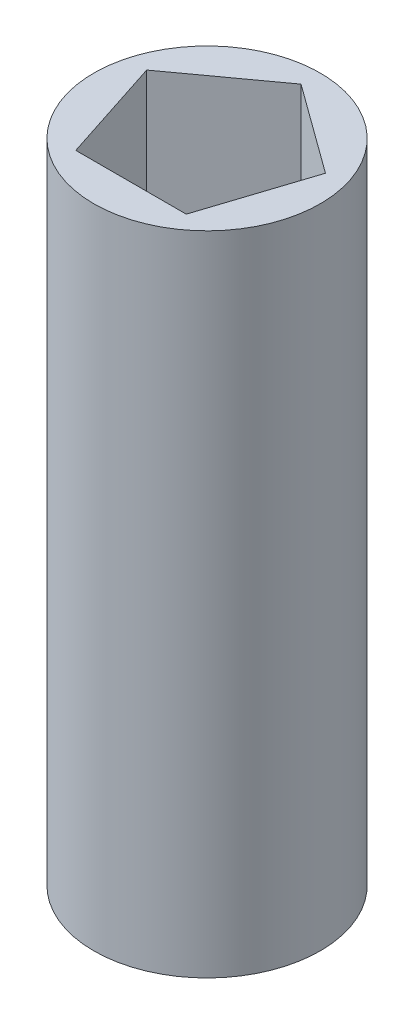
ISO-10303-21;
HEADER;
FILE_DESCRIPTION(('STEP AP214'),'2;1');
FILE_NAME('part.step','',(''),(''),'','','');
FILE_SCHEMA(('AUTOMOTIVE_DESIGN { 1 0 10303 214 1 1 1 1 }'));
ENDSEC;
DATA;
#1=APPLICATION_CONTEXT('core data for automotive mechanical design processes');
#2=APPLICATION_PROTOCOL_DEFINITION('international standard','automotive_design',2000,#1);
#3=PRODUCT_CONTEXT('',#1,'mechanical');
#4=PRODUCT('Part','Part','',(#3));
#5=PRODUCT_RELATED_PRODUCT_CATEGORY('part','',(#4));
#6=PRODUCT_DEFINITION_FORMATION('','',#4);
#7=PRODUCT_DEFINITION_CONTEXT('part definition',#1,'design');
#8=PRODUCT_DEFINITION('design','',#6,#7);
#9=PRODUCT_DEFINITION_SHAPE('','',#8);
#10=(LENGTH_UNIT() NAMED_UNIT(*) SI_UNIT(.MILLI.,.METRE.));
#11=(NAMED_UNIT(*) PLANE_ANGLE_UNIT() SI_UNIT($,.RADIAN.));
#12=(NAMED_UNIT(*) SI_UNIT($,.STERADIAN.) SOLID_ANGLE_UNIT());
#13=UNCERTAINTY_MEASURE_WITH_UNIT(LENGTH_MEASURE(1.E-05),#10,'distance_accuracy_value','');
#14=(GEOMETRIC_REPRESENTATION_CONTEXT(3) GLOBAL_UNCERTAINTY_ASSIGNED_CONTEXT((#13)) GLOBAL_UNIT_ASSIGNED_CONTEXT((#10,
#11,#12)) REPRESENTATION_CONTEXT('',''));
#15=CARTESIAN_POINT('',(0.,0.,0.));
#16=DIRECTION('',(0.,0.,1.));
#17=DIRECTION('',(1.,0.,0.));
#18=AXIS2_PLACEMENT_3D('',#15,#16,#17);
#19=CARTESIAN_POINT('',(0.,20.,0.));
#20=DIRECTION('',(0.,1.,0.));
#21=DIRECTION('',(0.,0.,1.));
#22=AXIS2_PLACEMENT_3D('',#19,#20,#21);
#23=PLANE('',#22);
#24=CARTESIAN_POINT('',(0.,20.,0.));
#25=DIRECTION('',(0.,1.,0.));
#26=DIRECTION('',(0.,0.,1.));
#27=AXIS2_PLACEMENT_3D('',#24,#25,#26);
#28=CIRCLE('',#27,3.5);
#29=CARTESIAN_POINT('',(0.,20.,3.5));
#30=VERTEX_POINT('',#29);
#31=EDGE_CURVE('E11',#30,#30,#28,.T.);
#32=ORIENTED_EDGE('',*,*,#31,.T.);
#33=EDGE_LOOP('',(#32));
#34=FACE_BOUND('',#33,.T.);
#35=DIRECTION('',(0.309016994374947,0.,-0.951056516295154));
#36=VECTOR('',#35,1.);
#37=CARTESIAN_POINT('',(1.7073749408126,20.,2.35));
#38=LINE('',#37,#36);
#39=CARTESIAN_POINT('',(1.7073749408126,20.,2.35));
#40=VERTEX_POINT('',#39);
#41=CARTESIAN_POINT('',(2.76259068577462,20.,-0.897620126437749));
#42=VERTEX_POINT('',#41);
#43=EDGE_CURVE('E88',#40,#42,#38,.T.);
#44=ORIENTED_EDGE('',*,*,#43,.F.);
#45=DIRECTION('',(1.,0.,0.));
#46=VECTOR('',#45,1.);
#47=CARTESIAN_POINT('',(-1.7073749408126,20.,2.35));
#48=LINE('',#47,#46);
#49=CARTESIAN_POINT('',(-1.7073749408126,20.,2.35));
#50=VERTEX_POINT('',#49);
#51=EDGE_CURVE('E80',#50,#40,#48,.T.);
#52=ORIENTED_EDGE('',*,*,#51,.F.);
#53=DIRECTION('',(0.309016994374948,0.,0.951056516295154));
#54=VECTOR('',#53,1.);
#55=CARTESIAN_POINT('',(-2.76259068577462,20.,-0.897620126437747));
#56=LINE('',#55,#54);
#57=CARTESIAN_POINT('',(-2.76259068577463,20.,-0.897620126437747));
#58=VERTEX_POINT('',#57);
#59=EDGE_CURVE('E106',#58,#50,#56,.T.);
#60=ORIENTED_EDGE('',*,*,#59,.F.);
#61=DIRECTION('',(-0.809016994374947,0.,0.587785252292473));
#62=VECTOR('',#61,1.);
#63=CARTESIAN_POINT('',(0.,20.,-2.90475974712451));
#64=LINE('',#63,#62);
#65=CARTESIAN_POINT('',(0.,20.,-2.90475974712451));
#66=VERTEX_POINT('',#65);
#67=EDGE_CURVE('E102',#66,#58,#64,.T.);
#68=ORIENTED_EDGE('',*,*,#67,.F.);
#69=DIRECTION('',(-0.809016994374948,0.,-0.587785252292473));
#70=VECTOR('',#69,1.);
#71=CARTESIAN_POINT('',(2.76259068577462,20.,-0.897620126437749));
#72=LINE('',#71,#70);
#73=EDGE_CURVE('E100',#42,#66,#72,.T.);
#74=ORIENTED_EDGE('',*,*,#73,.F.);
#75=EDGE_LOOP('',(#44,#52,#60,#68,#74));
#76=FACE_BOUND('',#75,.T.);
#77=ADVANCED_FACE('F33',(#34,#76),#23,.T.);
#78=CARTESIAN_POINT('',(0.,0.,0.));
#79=DIRECTION('',(0.,1.,0.));
#80=DIRECTION('',(0.,0.,1.));
#81=AXIS2_PLACEMENT_3D('',#78,#79,#80);
#82=PLANE('',#81);
#83=CARTESIAN_POINT('',(0.,0.,0.));
#84=DIRECTION('',(0.,1.,0.));
#85=DIRECTION('',(0.,0.,1.));
#86=AXIS2_PLACEMENT_3D('',#83,#84,#85);
#87=CIRCLE('',#86,3.5);
#88=CARTESIAN_POINT('',(0.,0.,3.5));
#89=VERTEX_POINT('',#88);
#90=EDGE_CURVE('E37',#89,#89,#87,.T.);
#91=ORIENTED_EDGE('',*,*,#90,.F.);
#92=EDGE_LOOP('',(#91));
#93=FACE_BOUND('',#92,.T.);
#94=DIRECTION('',(1.,0.,0.));
#95=VECTOR('',#94,1.);
#96=CARTESIAN_POINT('',(-1.7073749408126,0.,2.35));
#97=LINE('',#96,#95);
#98=CARTESIAN_POINT('',(-1.7073749408126,0.,2.35));
#99=VERTEX_POINT('',#98);
#100=CARTESIAN_POINT('',(1.7073749408126,0.,2.35));
#101=VERTEX_POINT('',#100);
#102=EDGE_CURVE('E56',#99,#101,#97,.T.);
#103=ORIENTED_EDGE('',*,*,#102,.T.);
#104=DIRECTION('',(0.309016994374947,0.,-0.951056516295154));
#105=VECTOR('',#104,1.);
#106=CARTESIAN_POINT('',(1.7073749408126,0.,2.35));
#107=LINE('',#106,#105);
#108=CARTESIAN_POINT('',(2.76259068577462,0.,-0.897620126437749));
#109=VERTEX_POINT('',#108);
#110=EDGE_CURVE('E95',#101,#109,#107,.T.);
#111=ORIENTED_EDGE('',*,*,#110,.T.);
#112=DIRECTION('',(-0.809016994374948,0.,-0.587785252292473));
#113=VECTOR('',#112,1.);
#114=CARTESIAN_POINT('',(2.76259068577462,0.,-0.897620126437749));
#115=LINE('',#114,#113);
#116=CARTESIAN_POINT('',(0.,0.,-2.90475974712451));
#117=VERTEX_POINT('',#116);
#118=EDGE_CURVE('E110',#109,#117,#115,.T.);
#119=ORIENTED_EDGE('',*,*,#118,.T.);
#120=DIRECTION('',(-0.809016994374947,0.,0.587785252292473));
#121=VECTOR('',#120,1.);
#122=CARTESIAN_POINT('',(0.,0.,-2.90475974712451));
#123=LINE('',#122,#121);
#124=CARTESIAN_POINT('',(-2.76259068577462,0.,-0.897620126437747));
#125=VERTEX_POINT('',#124);
#126=EDGE_CURVE('E113',#117,#125,#123,.T.);
#127=ORIENTED_EDGE('',*,*,#126,.T.);
#128=DIRECTION('',(0.309016994374948,0.,0.951056516295154));
#129=VECTOR('',#128,1.);
#130=CARTESIAN_POINT('',(-2.76259068577462,0.,-0.897620126437747));
#131=LINE('',#130,#129);
#132=EDGE_CURVE('E89',#125,#99,#131,.T.);
#133=ORIENTED_EDGE('',*,*,#132,.T.);
#134=EDGE_LOOP('',(#103,#111,#119,#127,#133));
#135=FACE_BOUND('',#134,.T.);
#136=ADVANCED_FACE('F128',(#93,#135),#82,.F.);
#137=CARTESIAN_POINT('',(0.,20.,0.));
#138=DIRECTION('',(0.,-1.,0.));
#139=DIRECTION('',(0.,0.,-1.));
#140=AXIS2_PLACEMENT_3D('',#137,#138,#139);
#141=CYLINDRICAL_SURFACE('',#140,3.5);
#142=ORIENTED_EDGE('',*,*,#31,.F.);
#143=EDGE_LOOP('',(#142));
#144=FACE_BOUND('',#143,.T.);
#145=ORIENTED_EDGE('',*,*,#90,.T.);
#146=EDGE_LOOP('',(#145));
#147=FACE_BOUND('',#146,.T.);
#148=ADVANCED_FACE('F35',(#144,#147),#141,.T.);
#149=CARTESIAN_POINT('',(-1.7073749408126,20.,2.35));
#150=DIRECTION('',(0.,0.,-1.));
#151=DIRECTION('',(-1.,0.,0.));
#152=AXIS2_PLACEMENT_3D('',#149,#150,#151);
#153=PLANE('',#152);
#154=ORIENTED_EDGE('',*,*,#102,.F.);
#155=DIRECTION('',(0.,-1.,0.));
#156=VECTOR('',#155,1.);
#157=CARTESIAN_POINT('',(-1.7073749408126,20.,2.35));
#158=LINE('',#157,#156);
#159=EDGE_CURVE('E84',#50,#99,#158,.T.);
#160=ORIENTED_EDGE('',*,*,#159,.F.);
#161=ORIENTED_EDGE('',*,*,#51,.T.);
#162=DIRECTION('',(0.,-1.,0.));
#163=VECTOR('',#162,1.);
#164=CARTESIAN_POINT('',(1.7073749408126,20.,2.35));
#165=LINE('',#164,#163);
#166=EDGE_CURVE('E83',#40,#101,#165,.T.);
#167=ORIENTED_EDGE('',*,*,#166,.T.);
#168=EDGE_LOOP('',(#154,#160,#161,#167));
#169=FACE_BOUND('',#168,.T.);
#170=ADVANCED_FACE('F82',(#169),#153,.T.);
#171=CARTESIAN_POINT('',(1.7073749408126,20.,2.35));
#172=DIRECTION('',(-0.951056516295154,0.,-0.309016994374947));
#173=DIRECTION('',(-0.309016994374947,0.,0.951056516295154));
#174=AXIS2_PLACEMENT_3D('',#171,#172,#173);
#175=PLANE('',#174);
#176=ORIENTED_EDGE('',*,*,#110,.F.);
#177=ORIENTED_EDGE('',*,*,#166,.F.);
#178=ORIENTED_EDGE('',*,*,#43,.T.);
#179=DIRECTION('',(0.,-1.,0.));
#180=VECTOR('',#179,1.);
#181=CARTESIAN_POINT('',(2.76259068577462,20.,-0.897620126437749));
#182=LINE('',#181,#180);
#183=EDGE_CURVE('E96',#42,#109,#182,.T.);
#184=ORIENTED_EDGE('',*,*,#183,.T.);
#185=EDGE_LOOP('',(#176,#177,#178,#184));
#186=FACE_BOUND('',#185,.T.);
#187=ADVANCED_FACE('F92',(#186),#175,.T.);
#188=CARTESIAN_POINT('',(2.76259068577462,20.,-0.897620126437749));
#189=DIRECTION('',(-0.587785252292473,0.,0.809016994374948));
#190=DIRECTION('',(0.809016994374948,0.,0.587785252292473));
#191=AXIS2_PLACEMENT_3D('',#188,#189,#190);
#192=PLANE('',#191);
#193=ORIENTED_EDGE('',*,*,#118,.F.);
#194=ORIENTED_EDGE('',*,*,#183,.F.);
#195=ORIENTED_EDGE('',*,*,#73,.T.);
#196=DIRECTION('',(0.,-1.,0.));
#197=VECTOR('',#196,1.);
#198=CARTESIAN_POINT('',(0.,20.,-2.90475974712451));
#199=LINE('',#198,#197);
#200=EDGE_CURVE('E120',#66,#117,#199,.T.);
#201=ORIENTED_EDGE('',*,*,#200,.T.);
#202=EDGE_LOOP('',(#193,#194,#195,#201));
#203=FACE_BOUND('',#202,.T.);
#204=ADVANCED_FACE('F124',(#203),#192,.T.);
#205=CARTESIAN_POINT('',(0.,20.,-2.90475974712451));
#206=DIRECTION('',(0.587785252292473,0.,0.809016994374947));
#207=DIRECTION('',(0.809016994374947,0.,-0.587785252292473));
#208=AXIS2_PLACEMENT_3D('',#205,#206,#207);
#209=PLANE('',#208);
#210=ORIENTED_EDGE('',*,*,#126,.F.);
#211=ORIENTED_EDGE('',*,*,#200,.F.);
#212=ORIENTED_EDGE('',*,*,#67,.T.);
#213=DIRECTION('',(0.,-1.,0.));
#214=VECTOR('',#213,1.);
#215=CARTESIAN_POINT('',(-2.76259068577462,20.,-0.897620126437747));
#216=LINE('',#215,#214);
#217=EDGE_CURVE('E48',#58,#125,#216,.T.);
#218=ORIENTED_EDGE('',*,*,#217,.T.);
#219=EDGE_LOOP('',(#210,#211,#212,#218));
#220=FACE_BOUND('',#219,.T.);
#221=ADVANCED_FACE('F131',(#220),#209,.T.);
#222=CARTESIAN_POINT('',(-2.76259068577462,20.,-0.897620126437747));
#223=DIRECTION('',(0.951056516295154,0.,-0.309016994374948));
#224=DIRECTION('',(-0.309016994374948,0.,-0.951056516295154));
#225=AXIS2_PLACEMENT_3D('',#222,#223,#224);
#226=PLANE('',#225);
#227=ORIENTED_EDGE('',*,*,#132,.F.);
#228=ORIENTED_EDGE('',*,*,#217,.F.);
#229=ORIENTED_EDGE('',*,*,#59,.T.);
#230=ORIENTED_EDGE('',*,*,#159,.T.);
#231=EDGE_LOOP('',(#227,#228,#229,#230));
#232=FACE_BOUND('',#231,.T.);
#233=ADVANCED_FACE('F129',(#232),#226,.T.);
#234=CLOSED_SHELL('',(#77,#136,#148,#170,#187,#204,#221,#233));
#235=MANIFOLD_SOLID_BREP('B2',#234);
#236=ADVANCED_BREP_SHAPE_REPRESENTATION('',(#18,#235),#14);
#237=SHAPE_DEFINITION_REPRESENTATION(#9,#236);
ENDSEC;
END-ISO-10303-21;
